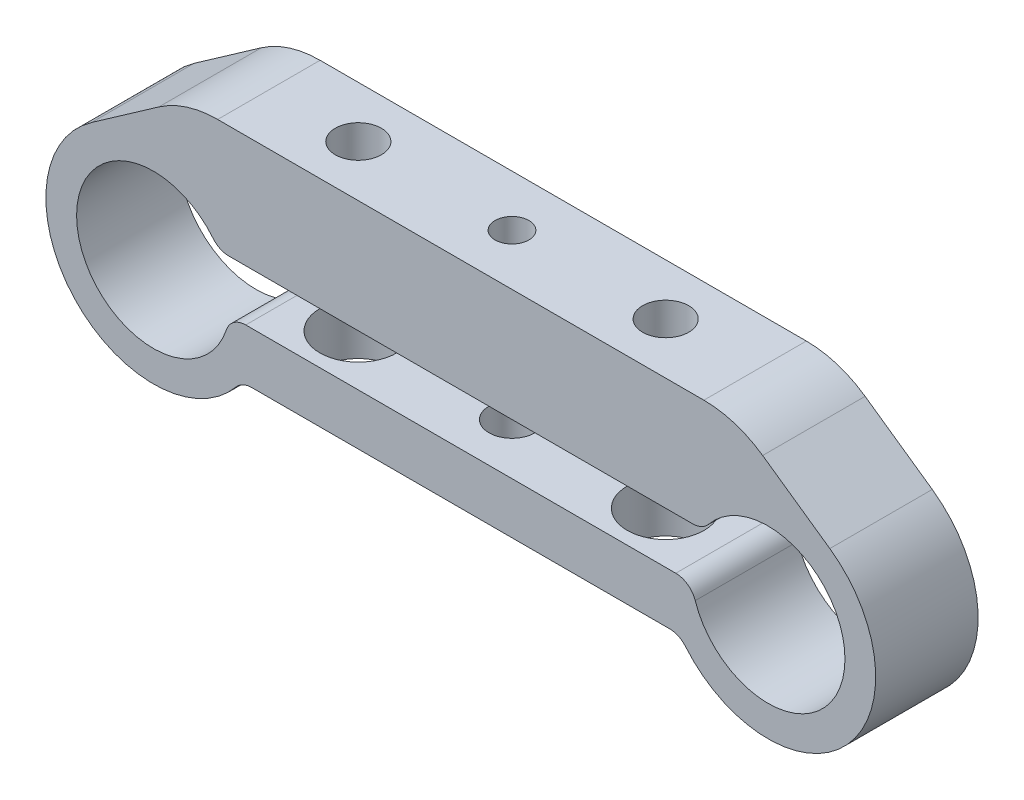
ISO-10303-21;
HEADER;
FILE_DESCRIPTION(('STEP AP214'),'2;1');
FILE_NAME('part.step','',(''),(''),'','','');
FILE_SCHEMA(('AUTOMOTIVE_DESIGN { 1 0 10303 214 1 1 1 1 }'));
ENDSEC;
DATA;
#1=APPLICATION_CONTEXT('core data for automotive mechanical design processes');
#2=APPLICATION_PROTOCOL_DEFINITION('international standard','automotive_design',2000,#1);
#3=PRODUCT_CONTEXT('',#1,'mechanical');
#4=PRODUCT('Part','Part','',(#3));
#5=PRODUCT_RELATED_PRODUCT_CATEGORY('part','',(#4));
#6=PRODUCT_DEFINITION_FORMATION('','',#4);
#7=PRODUCT_DEFINITION_CONTEXT('part definition',#1,'design');
#8=PRODUCT_DEFINITION('design','',#6,#7);
#9=PRODUCT_DEFINITION_SHAPE('','',#8);
#10=(LENGTH_UNIT() NAMED_UNIT(*) SI_UNIT(.MILLI.,.METRE.));
#11=(NAMED_UNIT(*) PLANE_ANGLE_UNIT() SI_UNIT($,.RADIAN.));
#12=(NAMED_UNIT(*) SI_UNIT($,.STERADIAN.) SOLID_ANGLE_UNIT());
#13=UNCERTAINTY_MEASURE_WITH_UNIT(LENGTH_MEASURE(1.E-05),#10,'distance_accuracy_value','');
#14=(GEOMETRIC_REPRESENTATION_CONTEXT(3) GLOBAL_UNCERTAINTY_ASSIGNED_CONTEXT((#13)) GLOBAL_UNIT_ASSIGNED_CONTEXT((#10,
#11,#12)) REPRESENTATION_CONTEXT('',''));
#15=CARTESIAN_POINT('',(0.,0.,0.));
#16=DIRECTION('',(0.,0.,1.));
#17=DIRECTION('',(1.,0.,0.));
#18=AXIS2_PLACEMENT_3D('',#15,#16,#17);
#19=CARTESIAN_POINT('',(-30.,0.,10.));
#20=DIRECTION('',(0.,0.,1.));
#21=DIRECTION('',(1.,0.,0.));
#22=AXIS2_PLACEMENT_3D('',#19,#20,#21);
#23=PLANE('',#22);
#24=DIRECTION('',(-1.,0.,0.));
#25=VECTOR('',#24,1.);
#26=CARTESIAN_POINT('',(-26.8839712528898,15.,10.));
#27=LINE('',#26,#25);
#28=CARTESIAN_POINT('',(23.7309833640999,15.,10.));
#29=VERTEX_POINT('',#28);
#30=CARTESIAN_POINT('',(-23.7309833641,15.,10.));
#31=VERTEX_POINT('',#30);
#32=EDGE_CURVE('E172',#29,#31,#27,.T.);
#33=ORIENTED_EDGE('',*,*,#32,.T.);
#34=CARTESIAN_POINT('',(-23.7309833641,5.,10.));
#35=DIRECTION('',(0.,0.,1.));
#36=DIRECTION('',(1.,0.,0.));
#37=AXIS2_PLACEMENT_3D('',#34,#35,#36);
#38=CIRCLE('',#37,10.);
#39=CARTESIAN_POINT('',(-29.4667477276105,13.1915204428899,10.));
#40=VERTEX_POINT('',#39);
#41=EDGE_CURVE('E168',#31,#40,#38,.T.);
#42=ORIENTED_EDGE('',*,*,#41,.T.);
#43=DIRECTION('',(-0.819152044288991,-0.573576436351047,0.));
#44=VECTOR('',#43,1.);
#45=CARTESIAN_POINT('',(-36.022552581686,8.60109646503441,10.));
#46=LINE('',#45,#44);
#47=CARTESIAN_POINT('',(-36.022552581686,8.60109646503441,10.));
#48=VERTEX_POINT('',#47);
#49=EDGE_CURVE('E161',#40,#48,#46,.T.);
#50=ORIENTED_EDGE('',*,*,#49,.T.);
#51=CARTESIAN_POINT('',(-30.,0.,10.));
#52=DIRECTION('',(0.,0.,1.));
#53=DIRECTION('',(1.,0.,0.));
#54=AXIS2_PLACEMENT_3D('',#51,#52,#53);
#55=CIRCLE('',#54,10.5);
#56=CARTESIAN_POINT('',(-21.9320634608346,-6.72,10.));
#57=VERTEX_POINT('',#56);
#58=EDGE_CURVE('E165',#48,#57,#55,.T.);
#59=ORIENTED_EDGE('',*,*,#58,.T.);
#60=CARTESIAN_POINT('',(-20.3953136438507,-8.,10.));
#61=DIRECTION('',(0.,0.,1.));
#62=DIRECTION('',(1.,0.,0.));
#63=AXIS2_PLACEMENT_3D('',#60,#61,#62);
#64=CIRCLE('',#63,2.);
#65=CARTESIAN_POINT('',(-20.3953136438507,-6.,10.));
#66=VERTEX_POINT('',#65);
#67=EDGE_CURVE('E11',#57,#66,#64,.F.);
#68=ORIENTED_EDGE('',*,*,#67,.T.);
#69=DIRECTION('',(1.,0.,0.));
#70=VECTOR('',#69,1.);
#71=CARTESIAN_POINT('',(-21.383156030193,-6.,10.));
#72=LINE('',#71,#70);
#73=CARTESIAN_POINT('',(20.3953136438507,-6.,10.));
#74=VERTEX_POINT('',#73);
#75=EDGE_CURVE('E188',#66,#74,#72,.T.);
#76=ORIENTED_EDGE('',*,*,#75,.T.);
#77=CARTESIAN_POINT('',(20.3953136438507,-8.,10.));
#78=DIRECTION('',(0.,0.,1.));
#79=DIRECTION('',(1.,0.,0.));
#80=AXIS2_PLACEMENT_3D('',#77,#78,#79);
#81=CIRCLE('',#80,2.);
#82=CARTESIAN_POINT('',(21.9320634608346,-6.72,10.));
#83=VERTEX_POINT('',#82);
#84=EDGE_CURVE('E274',#74,#83,#81,.F.);
#85=ORIENTED_EDGE('',*,*,#84,.T.);
#86=CARTESIAN_POINT('',(30.,0.,10.));
#87=DIRECTION('',(0.,0.,1.));
#88=DIRECTION('',(1.,0.,0.));
#89=AXIS2_PLACEMENT_3D('',#86,#87,#88);
#90=CIRCLE('',#89,10.5);
#91=CARTESIAN_POINT('',(36.0225525816859,8.60109646503445,10.));
#92=VERTEX_POINT('',#91);
#93=EDGE_CURVE('E191',#83,#92,#90,.T.);
#94=ORIENTED_EDGE('',*,*,#93,.T.);
#95=DIRECTION('',(-0.819152044288995,0.573576436351041,0.));
#96=VECTOR('',#95,1.);
#97=CARTESIAN_POINT('',(36.0225525816859,8.60109646503445,10.));
#98=LINE('',#97,#96);
#99=CARTESIAN_POINT('',(29.4667477276103,13.1915204428899,10.));
#100=VERTEX_POINT('',#99);
#101=EDGE_CURVE('E211',#92,#100,#98,.T.);
#102=ORIENTED_EDGE('',*,*,#101,.T.);
#103=CARTESIAN_POINT('',(23.7309833640999,5.,10.));
#104=DIRECTION('',(0.,0.,1.));
#105=DIRECTION('',(1.,0.,0.));
#106=AXIS2_PLACEMENT_3D('',#103,#104,#105);
#107=CIRCLE('',#106,10.);
#108=EDGE_CURVE('E224',#100,#29,#107,.T.);
#109=ORIENTED_EDGE('',*,*,#108,.T.);
#110=EDGE_LOOP('',(#33,#42,#50,#59,#68,#76,#85,#94,#102,#109));
#111=FACE_BOUND('',#110,.T.);
#112=DIRECTION('',(1.,0.,0.));
#113=VECTOR('',#112,1.);
#114=CARTESIAN_POINT('',(-22.5669656263407,-1.,10.));
#115=LINE('',#114,#113);
#116=CARTESIAN_POINT('',(-20.98612181134,-1.,10.));
#117=VERTEX_POINT('',#116);
#118=CARTESIAN_POINT('',(20.98612181134,-1.,10.));
#119=VERTEX_POINT('',#118);
#120=EDGE_CURVE('E322',#117,#119,#115,.T.);
#121=ORIENTED_EDGE('',*,*,#120,.F.);
#122=CARTESIAN_POINT('',(-20.98612181134,-3.,10.));
#123=DIRECTION('',(0.,0.,1.));
#124=DIRECTION('',(1.,0.,0.));
#125=AXIS2_PLACEMENT_3D('',#122,#123,#124);
#126=CIRCLE('',#125,2.);
#127=CARTESIAN_POINT('',(-22.8837803773737,-2.36842105263158,10.));
#128=VERTEX_POINT('',#127);
#129=EDGE_CURVE('E261',#117,#128,#126,.T.);
#130=ORIENTED_EDGE('',*,*,#129,.T.);
#131=CARTESIAN_POINT('',(-30.,0.,10.));
#132=DIRECTION('',(0.,0.,1.));
#133=DIRECTION('',(1.,0.,0.));
#134=AXIS2_PLACEMENT_3D('',#131,#132,#133);
#135=CIRCLE('',#134,7.5);
#136=CARTESIAN_POINT('',(-24.1851632121094,4.73684210526316,10.));
#137=VERTEX_POINT('',#136);
#138=EDGE_CURVE('E307',#137,#128,#135,.T.);
#139=ORIENTED_EDGE('',*,*,#138,.F.);
#140=CARTESIAN_POINT('',(-22.6345400686719,6.,10.));
#141=DIRECTION('',(0.,0.,1.));
#142=DIRECTION('',(1.,0.,0.));
#143=AXIS2_PLACEMENT_3D('',#140,#141,#142);
#144=CIRCLE('',#143,2.);
#145=CARTESIAN_POINT('',(-22.6345400686719,4.,10.));
#146=VERTEX_POINT('',#145);
#147=EDGE_CURVE('E259',#137,#146,#144,.T.);
#148=ORIENTED_EDGE('',*,*,#147,.T.);
#149=DIRECTION('',(-1.,0.,0.));
#150=VECTOR('',#149,1.);
#151=CARTESIAN_POINT('',(-23.6557112297752,4.,10.));
#152=LINE('',#151,#150);
#153=CARTESIAN_POINT('',(22.6345400686719,4.,10.));
#154=VERTEX_POINT('',#153);
#155=EDGE_CURVE('E200',#154,#146,#152,.T.);
#156=ORIENTED_EDGE('',*,*,#155,.F.);
#157=CARTESIAN_POINT('',(22.6345400686719,6.,10.));
#158=DIRECTION('',(0.,0.,1.));
#159=DIRECTION('',(1.,0.,0.));
#160=AXIS2_PLACEMENT_3D('',#157,#158,#159);
#161=CIRCLE('',#160,2.);
#162=CARTESIAN_POINT('',(24.1851632121094,4.73684210526316,10.));
#163=VERTEX_POINT('',#162);
#164=EDGE_CURVE('E50',#154,#163,#161,.T.);
#165=ORIENTED_EDGE('',*,*,#164,.T.);
#166=CARTESIAN_POINT('',(30.,0.,10.));
#167=DIRECTION('',(0.,0.,1.));
#168=DIRECTION('',(1.,0.,0.));
#169=AXIS2_PLACEMENT_3D('',#166,#167,#168);
#170=CIRCLE('',#169,7.5);
#171=CARTESIAN_POINT('',(22.8837803773737,-2.36842105263158,10.));
#172=VERTEX_POINT('',#171);
#173=EDGE_CURVE('E320',#172,#163,#170,.T.);
#174=ORIENTED_EDGE('',*,*,#173,.F.);
#175=CARTESIAN_POINT('',(20.98612181134,-3.,10.));
#176=DIRECTION('',(0.,0.,1.));
#177=DIRECTION('',(1.,0.,0.));
#178=AXIS2_PLACEMENT_3D('',#175,#176,#177);
#179=CIRCLE('',#178,2.);
#180=EDGE_CURVE('E257',#172,#119,#179,.T.);
#181=ORIENTED_EDGE('',*,*,#180,.T.);
#182=EDGE_LOOP('',(#121,#130,#139,#148,#156,#165,#174,#181));
#183=FACE_BOUND('',#182,.T.);
#184=ADVANCED_FACE('F35',(#111,#183),#23,.T.);
#185=CARTESIAN_POINT('',(-30.,0.,0.));
#186=DIRECTION('',(0.,0.,1.));
#187=DIRECTION('',(1.,0.,0.));
#188=AXIS2_PLACEMENT_3D('',#185,#186,#187);
#189=PLANE('',#188);
#190=DIRECTION('',(-0.819152044288991,-0.573576436351047,0.));
#191=VECTOR('',#190,1.);
#192=CARTESIAN_POINT('',(-36.022552581686,8.60109646503441,0.));
#193=LINE('',#192,#191);
#194=CARTESIAN_POINT('',(-29.4667477276105,13.1915204428899,0.));
#195=VERTEX_POINT('',#194);
#196=CARTESIAN_POINT('',(-36.022552581686,8.60109646503441,0.));
#197=VERTEX_POINT('',#196);
#198=EDGE_CURVE('E178',#195,#197,#193,.T.);
#199=ORIENTED_EDGE('',*,*,#198,.F.);
#200=CARTESIAN_POINT('',(-23.7309833641,5.,0.));
#201=DIRECTION('',(0.,0.,1.));
#202=DIRECTION('',(1.,0.,0.));
#203=AXIS2_PLACEMENT_3D('',#200,#201,#202);
#204=CIRCLE('',#203,10.);
#205=CARTESIAN_POINT('',(-23.7309833641,15.,0.));
#206=VERTEX_POINT('',#205);
#207=EDGE_CURVE('E217',#195,#206,#204,.F.);
#208=ORIENTED_EDGE('',*,*,#207,.T.);
#209=DIRECTION('',(-1.,0.,0.));
#210=VECTOR('',#209,1.);
#211=CARTESIAN_POINT('',(-26.8839712528898,15.,0.));
#212=LINE('',#211,#210);
#213=CARTESIAN_POINT('',(23.7309833640999,15.,0.));
#214=VERTEX_POINT('',#213);
#215=EDGE_CURVE('E199',#214,#206,#212,.T.);
#216=ORIENTED_EDGE('',*,*,#215,.F.);
#217=CARTESIAN_POINT('',(23.7309833640999,5.,0.));
#218=DIRECTION('',(0.,0.,1.));
#219=DIRECTION('',(1.,0.,0.));
#220=AXIS2_PLACEMENT_3D('',#217,#218,#219);
#221=CIRCLE('',#220,10.);
#222=CARTESIAN_POINT('',(29.4667477276103,13.1915204428899,0.));
#223=VERTEX_POINT('',#222);
#224=EDGE_CURVE('E215',#214,#223,#221,.F.);
#225=ORIENTED_EDGE('',*,*,#224,.T.);
#226=DIRECTION('',(-0.819152044288995,0.573576436351041,0.));
#227=VECTOR('',#226,1.);
#228=CARTESIAN_POINT('',(36.0225525816859,8.60109646503445,0.));
#229=LINE('',#228,#227);
#230=CARTESIAN_POINT('',(36.0225525816859,8.60109646503445,0.));
#231=VERTEX_POINT('',#230);
#232=EDGE_CURVE('E196',#231,#223,#229,.T.);
#233=ORIENTED_EDGE('',*,*,#232,.F.);
#234=CARTESIAN_POINT('',(30.,0.,0.));
#235=DIRECTION('',(0.,0.,1.));
#236=DIRECTION('',(1.,0.,0.));
#237=AXIS2_PLACEMENT_3D('',#234,#235,#236);
#238=CIRCLE('',#237,10.5);
#239=CARTESIAN_POINT('',(21.9320634608346,-6.72,0.));
#240=VERTEX_POINT('',#239);
#241=EDGE_CURVE('E209',#240,#231,#238,.T.);
#242=ORIENTED_EDGE('',*,*,#241,.F.);
#243=CARTESIAN_POINT('',(20.3953136438507,-8.,0.));
#244=DIRECTION('',(0.,0.,1.));
#245=DIRECTION('',(1.,0.,0.));
#246=AXIS2_PLACEMENT_3D('',#243,#244,#245);
#247=CIRCLE('',#246,2.);
#248=CARTESIAN_POINT('',(20.3953136438507,-6.,0.));
#249=VERTEX_POINT('',#248);
#250=EDGE_CURVE('E272',#240,#249,#247,.T.);
#251=ORIENTED_EDGE('',*,*,#250,.T.);
#252=DIRECTION('',(1.,0.,0.));
#253=VECTOR('',#252,1.);
#254=CARTESIAN_POINT('',(-21.383156030193,-6.,0.));
#255=LINE('',#254,#253);
#256=CARTESIAN_POINT('',(-20.3953136438507,-6.,0.));
#257=VERTEX_POINT('',#256);
#258=EDGE_CURVE('E206',#257,#249,#255,.T.);
#259=ORIENTED_EDGE('',*,*,#258,.F.);
#260=CARTESIAN_POINT('',(-20.3953136438507,-8.,0.));
#261=DIRECTION('',(0.,0.,1.));
#262=DIRECTION('',(1.,0.,0.));
#263=AXIS2_PLACEMENT_3D('',#260,#261,#262);
#264=CIRCLE('',#263,2.);
#265=CARTESIAN_POINT('',(-21.9320634608346,-6.72,0.));
#266=VERTEX_POINT('',#265);
#267=EDGE_CURVE('E43',#257,#266,#264,.T.);
#268=ORIENTED_EDGE('',*,*,#267,.T.);
#269=CARTESIAN_POINT('',(-30.,0.,0.));
#270=DIRECTION('',(0.,0.,1.));
#271=DIRECTION('',(1.,0.,0.));
#272=AXIS2_PLACEMENT_3D('',#269,#270,#271);
#273=CIRCLE('',#272,10.5);
#274=EDGE_CURVE('E204',#197,#266,#273,.T.);
#275=ORIENTED_EDGE('',*,*,#274,.F.);
#276=EDGE_LOOP('',(#199,#208,#216,#225,#233,#242,#251,#259,#268,#275));
#277=FACE_BOUND('',#276,.T.);
#278=CARTESIAN_POINT('',(-30.,0.,0.));
#279=DIRECTION('',(0.,0.,1.));
#280=DIRECTION('',(1.,0.,0.));
#281=AXIS2_PLACEMENT_3D('',#278,#279,#280);
#282=CIRCLE('',#281,7.5);
#283=CARTESIAN_POINT('',(-24.1851632121094,4.73684210526316,0.));
#284=VERTEX_POINT('',#283);
#285=CARTESIAN_POINT('',(-22.8837803773737,-2.36842105263158,0.));
#286=VERTEX_POINT('',#285);
#287=EDGE_CURVE('E314',#284,#286,#282,.T.);
#288=ORIENTED_EDGE('',*,*,#287,.T.);
#289=CARTESIAN_POINT('',(-20.98612181134,-3.,0.));
#290=DIRECTION('',(0.,0.,1.));
#291=DIRECTION('',(1.,0.,0.));
#292=AXIS2_PLACEMENT_3D('',#289,#290,#291);
#293=CIRCLE('',#292,2.);
#294=CARTESIAN_POINT('',(-20.98612181134,-1.,0.));
#295=VERTEX_POINT('',#294);
#296=EDGE_CURVE('E249',#286,#295,#293,.F.);
#297=ORIENTED_EDGE('',*,*,#296,.T.);
#298=DIRECTION('',(1.,0.,0.));
#299=VECTOR('',#298,1.);
#300=CARTESIAN_POINT('',(-22.5669656263407,-1.,0.));
#301=LINE('',#300,#299);
#302=CARTESIAN_POINT('',(20.98612181134,-1.,0.));
#303=VERTEX_POINT('',#302);
#304=EDGE_CURVE('E311',#295,#303,#301,.T.);
#305=ORIENTED_EDGE('',*,*,#304,.T.);
#306=CARTESIAN_POINT('',(20.98612181134,-3.,0.));
#307=DIRECTION('',(0.,0.,1.));
#308=DIRECTION('',(1.,0.,0.));
#309=AXIS2_PLACEMENT_3D('',#306,#307,#308);
#310=CIRCLE('',#309,2.);
#311=CARTESIAN_POINT('',(22.8837803773737,-2.36842105263158,0.));
#312=VERTEX_POINT('',#311);
#313=EDGE_CURVE('E245',#303,#312,#310,.F.);
#314=ORIENTED_EDGE('',*,*,#313,.T.);
#315=CARTESIAN_POINT('',(30.,0.,0.));
#316=DIRECTION('',(0.,0.,1.));
#317=DIRECTION('',(1.,0.,0.));
#318=AXIS2_PLACEMENT_3D('',#315,#316,#317);
#319=CIRCLE('',#318,7.5);
#320=CARTESIAN_POINT('',(24.1851632121094,4.73684210526316,0.));
#321=VERTEX_POINT('',#320);
#322=EDGE_CURVE('E308',#312,#321,#319,.T.);
#323=ORIENTED_EDGE('',*,*,#322,.T.);
#324=CARTESIAN_POINT('',(22.6345400686719,6.,0.));
#325=DIRECTION('',(0.,0.,1.));
#326=DIRECTION('',(1.,0.,0.));
#327=AXIS2_PLACEMENT_3D('',#324,#325,#326);
#328=CIRCLE('',#327,2.);
#329=CARTESIAN_POINT('',(22.6345400686719,4.,0.));
#330=VERTEX_POINT('',#329);
#331=EDGE_CURVE('E243',#321,#330,#328,.F.);
#332=ORIENTED_EDGE('',*,*,#331,.T.);
#333=DIRECTION('',(-1.,0.,0.));
#334=VECTOR('',#333,1.);
#335=CARTESIAN_POINT('',(-23.6557112297752,4.,0.));
#336=LINE('',#335,#334);
#337=CARTESIAN_POINT('',(-22.6345400686719,4.,0.));
#338=VERTEX_POINT('',#337);
#339=EDGE_CURVE('E304',#330,#338,#336,.T.);
#340=ORIENTED_EDGE('',*,*,#339,.T.);
#341=CARTESIAN_POINT('',(-22.6345400686719,6.,0.));
#342=DIRECTION('',(0.,0.,1.));
#343=DIRECTION('',(1.,0.,0.));
#344=AXIS2_PLACEMENT_3D('',#341,#342,#343);
#345=CIRCLE('',#344,2.);
#346=EDGE_CURVE('E247',#338,#284,#345,.F.);
#347=ORIENTED_EDGE('',*,*,#346,.T.);
#348=EDGE_LOOP('',(#288,#297,#305,#314,#323,#332,#340,#347));
#349=FACE_BOUND('',#348,.T.);
#350=ADVANCED_FACE('F277',(#277,#349),#189,.F.);
#351=CARTESIAN_POINT('',(36.0225525816859,8.60109646503445,10.));
#352=DIRECTION('',(-0.573576436351041,-0.819152044288995,0.));
#353=DIRECTION('',(0.819152044288995,-0.573576436351041,0.));
#354=AXIS2_PLACEMENT_3D('',#351,#352,#353);
#355=PLANE('',#354);
#356=ORIENTED_EDGE('',*,*,#232,.T.);
#357=DIRECTION('',(0.,0.,-1.));
#358=VECTOR('',#357,1.);
#359=CARTESIAN_POINT('',(29.4667477276103,13.1915204428899,10.));
#360=LINE('',#359,#358);
#361=EDGE_CURVE('E227',#223,#100,#360,.F.);
#362=ORIENTED_EDGE('',*,*,#361,.T.);
#363=ORIENTED_EDGE('',*,*,#101,.F.);
#364=DIRECTION('',(0.,0.,-1.));
#365=VECTOR('',#364,1.);
#366=CARTESIAN_POINT('',(36.0225525816859,8.60109646503445,10.));
#367=LINE('',#366,#365);
#368=EDGE_CURVE('E183',#92,#231,#367,.T.);
#369=ORIENTED_EDGE('',*,*,#368,.T.);
#370=EDGE_LOOP('',(#356,#362,#363,#369));
#371=FACE_BOUND('',#370,.T.);
#372=ADVANCED_FACE('F299',(#371),#355,.F.);
#373=CARTESIAN_POINT('',(-26.8839712528898,15.,10.));
#374=DIRECTION('',(0.,-1.,0.));
#375=DIRECTION('',(0.,0.,-1.));
#376=AXIS2_PLACEMENT_3D('',#373,#374,#375);
#377=PLANE('',#376);
#378=CARTESIAN_POINT('',(0.,15.,5.));
#379=DIRECTION('',(0.,-1.,0.));
#380=DIRECTION('',(0.,0.,-1.));
#381=AXIS2_PLACEMENT_3D('',#378,#379,#380);
#382=CIRCLE('',#381,1.65);
#383=CARTESIAN_POINT('',(0.,15.,3.35));
#384=VERTEX_POINT('',#383);
#385=EDGE_CURVE('E356',#384,#384,#382,.T.);
#386=ORIENTED_EDGE('',*,*,#385,.T.);
#387=EDGE_LOOP('',(#386));
#388=FACE_BOUND('',#387,.T.);
#389=CARTESIAN_POINT('',(15.,15.,5.));
#390=DIRECTION('',(0.,-1.,0.));
#391=DIRECTION('',(0.,0.,-1.));
#392=AXIS2_PLACEMENT_3D('',#389,#390,#391);
#393=CIRCLE('',#392,2.25);
#394=CARTESIAN_POINT('',(15.,15.,2.75));
#395=VERTEX_POINT('',#394);
#396=EDGE_CURVE('E344',#395,#395,#393,.T.);
#397=ORIENTED_EDGE('',*,*,#396,.T.);
#398=EDGE_LOOP('',(#397));
#399=FACE_BOUND('',#398,.T.);
#400=CARTESIAN_POINT('',(-15.,15.,5.));
#401=DIRECTION('',(0.,-1.,0.));
#402=DIRECTION('',(0.,0.,-1.));
#403=AXIS2_PLACEMENT_3D('',#400,#401,#402);
#404=CIRCLE('',#403,2.25);
#405=CARTESIAN_POINT('',(-15.,15.,2.75));
#406=VERTEX_POINT('',#405);
#407=EDGE_CURVE('E338',#406,#406,#404,.T.);
#408=ORIENTED_EDGE('',*,*,#407,.T.);
#409=EDGE_LOOP('',(#408));
#410=FACE_BOUND('',#409,.T.);
#411=ORIENTED_EDGE('',*,*,#215,.T.);
#412=DIRECTION('',(0.,0.,-1.));
#413=VECTOR('',#412,1.);
#414=CARTESIAN_POINT('',(-23.7309833641,15.,10.));
#415=LINE('',#414,#413);
#416=EDGE_CURVE('E222',#206,#31,#415,.F.);
#417=ORIENTED_EDGE('',*,*,#416,.T.);
#418=ORIENTED_EDGE('',*,*,#32,.F.);
#419=DIRECTION('',(0.,0.,-1.));
#420=VECTOR('',#419,1.);
#421=CARTESIAN_POINT('',(23.7309833640999,15.,10.));
#422=LINE('',#421,#420);
#423=EDGE_CURVE('E219',#29,#214,#422,.T.);
#424=ORIENTED_EDGE('',*,*,#423,.T.);
#425=EDGE_LOOP('',(#411,#417,#418,#424));
#426=FACE_BOUND('',#425,.T.);
#427=ADVANCED_FACE('F423',(#388,#399,#410,#426),#377,.F.);
#428=CARTESIAN_POINT('',(-36.022552581686,8.60109646503441,10.));
#429=DIRECTION('',(0.573576436351047,-0.819152044288991,0.));
#430=DIRECTION('',(0.819152044288991,0.573576436351047,0.));
#431=AXIS2_PLACEMENT_3D('',#428,#429,#430);
#432=PLANE('',#431);
#433=ORIENTED_EDGE('',*,*,#49,.F.);
#434=DIRECTION('',(0.,0.,-1.));
#435=VECTOR('',#434,1.);
#436=CARTESIAN_POINT('',(-29.4667477276105,13.1915204428899,10.));
#437=LINE('',#436,#435);
#438=EDGE_CURVE('E182',#40,#195,#437,.T.);
#439=ORIENTED_EDGE('',*,*,#438,.T.);
#440=ORIENTED_EDGE('',*,*,#198,.T.);
#441=DIRECTION('',(0.,0.,-1.));
#442=VECTOR('',#441,1.);
#443=CARTESIAN_POINT('',(-36.022552581686,8.60109646503441,10.));
#444=LINE('',#443,#442);
#445=EDGE_CURVE('E175',#48,#197,#444,.T.);
#446=ORIENTED_EDGE('',*,*,#445,.F.);
#447=EDGE_LOOP('',(#433,#439,#440,#446));
#448=FACE_BOUND('',#447,.T.);
#449=ADVANCED_FACE('F176',(#448),#432,.F.);
#450=CARTESIAN_POINT('',(-30.,0.,10.));
#451=DIRECTION('',(0.,0.,-1.));
#452=DIRECTION('',(-1.,0.,0.));
#453=AXIS2_PLACEMENT_3D('',#450,#451,#452);
#454=CYLINDRICAL_SURFACE('',#453,10.5);
#455=ORIENTED_EDGE('',*,*,#274,.T.);
#456=DIRECTION('',(0.,0.,-1.));
#457=VECTOR('',#456,1.);
#458=CARTESIAN_POINT('',(-21.9320634608346,-6.72,10.));
#459=LINE('',#458,#457);
#460=EDGE_CURVE('E187',#266,#57,#459,.F.);
#461=ORIENTED_EDGE('',*,*,#460,.T.);
#462=ORIENTED_EDGE('',*,*,#58,.F.);
#463=ORIENTED_EDGE('',*,*,#445,.T.);
#464=EDGE_LOOP('',(#455,#461,#462,#463));
#465=FACE_BOUND('',#464,.T.);
#466=ADVANCED_FACE('F185',(#465),#454,.T.);
#467=CARTESIAN_POINT('',(-21.383156030193,-6.,10.));
#468=DIRECTION('',(0.,1.,0.));
#469=DIRECTION('',(0.,0.,1.));
#470=AXIS2_PLACEMENT_3D('',#467,#468,#469);
#471=PLANE('',#470);
#472=CARTESIAN_POINT('',(0.,-6.,5.));
#473=DIRECTION('',(0.,-1.,0.));
#474=DIRECTION('',(0.,0.,-1.));
#475=AXIS2_PLACEMENT_3D('',#472,#473,#474);
#476=CIRCLE('',#475,2.24999999999999);
#477=CARTESIAN_POINT('',(0.,-6.,2.75000000000001));
#478=VERTEX_POINT('',#477);
#479=EDGE_CURVE('E353',#478,#478,#476,.T.);
#480=ORIENTED_EDGE('',*,*,#479,.F.);
#481=EDGE_LOOP('',(#480));
#482=FACE_BOUND('',#481,.T.);
#483=CARTESIAN_POINT('',(15.,-6.,5.));
#484=DIRECTION('',(0.,-1.,0.));
#485=DIRECTION('',(0.,0.,-1.));
#486=AXIS2_PLACEMENT_3D('',#483,#484,#485);
#487=CIRCLE('',#486,3.75);
#488=CARTESIAN_POINT('',(15.,-6.,1.25));
#489=VERTEX_POINT('',#488);
#490=EDGE_CURVE('E332',#489,#489,#487,.T.);
#491=ORIENTED_EDGE('',*,*,#490,.F.);
#492=EDGE_LOOP('',(#491));
#493=FACE_BOUND('',#492,.T.);
#494=CARTESIAN_POINT('',(-15.,-6.,5.));
#495=DIRECTION('',(0.,-1.,0.));
#496=DIRECTION('',(0.,0.,-1.));
#497=AXIS2_PLACEMENT_3D('',#494,#495,#496);
#498=CIRCLE('',#497,3.75);
#499=CARTESIAN_POINT('',(-15.,-6.,1.25));
#500=VERTEX_POINT('',#499);
#501=EDGE_CURVE('E317',#500,#500,#498,.T.);
#502=ORIENTED_EDGE('',*,*,#501,.F.);
#503=EDGE_LOOP('',(#502));
#504=FACE_BOUND('',#503,.T.);
#505=ORIENTED_EDGE('',*,*,#258,.T.);
#506=DIRECTION('',(0.,0.,1.));
#507=VECTOR('',#506,1.);
#508=CARTESIAN_POINT('',(20.3953136438507,-6.,10.));
#509=LINE('',#508,#507);
#510=EDGE_CURVE('E235',#249,#74,#509,.T.);
#511=ORIENTED_EDGE('',*,*,#510,.T.);
#512=ORIENTED_EDGE('',*,*,#75,.F.);
#513=DIRECTION('',(0.,0.,1.));
#514=VECTOR('',#513,1.);
#515=CARTESIAN_POINT('',(-20.3953136438507,-6.,0.));
#516=LINE('',#515,#514);
#517=EDGE_CURVE('E232',#66,#257,#516,.F.);
#518=ORIENTED_EDGE('',*,*,#517,.T.);
#519=EDGE_LOOP('',(#505,#511,#512,#518));
#520=FACE_BOUND('',#519,.T.);
#521=ADVANCED_FACE('F285',(#482,#493,#504,#520),#471,.F.);
#522=CARTESIAN_POINT('',(30.,0.,10.));
#523=DIRECTION('',(0.,0.,-1.));
#524=DIRECTION('',(-1.,0.,0.));
#525=AXIS2_PLACEMENT_3D('',#522,#523,#524);
#526=CYLINDRICAL_SURFACE('',#525,10.5);
#527=ORIENTED_EDGE('',*,*,#93,.F.);
#528=DIRECTION('',(0.,0.,-1.));
#529=VECTOR('',#528,1.);
#530=CARTESIAN_POINT('',(21.9320634608346,-6.72,10.));
#531=LINE('',#530,#529);
#532=EDGE_CURVE('E229',#83,#240,#531,.T.);
#533=ORIENTED_EDGE('',*,*,#532,.T.);
#534=ORIENTED_EDGE('',*,*,#241,.T.);
#535=ORIENTED_EDGE('',*,*,#368,.F.);
#536=EDGE_LOOP('',(#527,#533,#534,#535));
#537=FACE_BOUND('',#536,.T.);
#538=ADVANCED_FACE('F294',(#537),#526,.T.);
#539=CARTESIAN_POINT('',(-30.,0.,10.));
#540=DIRECTION('',(0.,0.,-1.));
#541=DIRECTION('',(-1.,0.,0.));
#542=AXIS2_PLACEMENT_3D('',#539,#540,#541);
#543=CYLINDRICAL_SURFACE('',#542,7.5);
#544=ORIENTED_EDGE('',*,*,#138,.T.);
#545=DIRECTION('',(0.,0.,-1.));
#546=VECTOR('',#545,1.);
#547=CARTESIAN_POINT('',(-22.8837803773737,-2.36842105263158,10.));
#548=LINE('',#547,#546);
#549=EDGE_CURVE('E240',#128,#286,#548,.T.);
#550=ORIENTED_EDGE('',*,*,#549,.T.);
#551=ORIENTED_EDGE('',*,*,#287,.F.);
#552=DIRECTION('',(0.,0.,-1.));
#553=VECTOR('',#552,1.);
#554=CARTESIAN_POINT('',(-24.1851632121094,4.73684210526316,10.));
#555=LINE('',#554,#553);
#556=EDGE_CURVE('E238',#284,#137,#555,.F.);
#557=ORIENTED_EDGE('',*,*,#556,.T.);
#558=EDGE_LOOP('',(#544,#550,#551,#557));
#559=FACE_BOUND('',#558,.T.);
#560=ADVANCED_FACE('F384',(#559),#543,.F.);
#561=CARTESIAN_POINT('',(-22.5669656263407,-1.,10.));
#562=DIRECTION('',(0.,1.,0.));
#563=DIRECTION('',(0.,0.,1.));
#564=AXIS2_PLACEMENT_3D('',#561,#562,#563);
#565=PLANE('',#564);
#566=CARTESIAN_POINT('',(0.,-1.,5.));
#567=DIRECTION('',(0.,1.,0.));
#568=DIRECTION('',(0.,0.,1.));
#569=AXIS2_PLACEMENT_3D('',#566,#567,#568);
#570=CIRCLE('',#569,2.24999999999999);
#571=CARTESIAN_POINT('',(0.,-1.,7.24999999999999));
#572=VERTEX_POINT('',#571);
#573=EDGE_CURVE('E350',#572,#572,#570,.T.);
#574=ORIENTED_EDGE('',*,*,#573,.F.);
#575=EDGE_LOOP('',(#574));
#576=FACE_BOUND('',#575,.T.);
#577=CARTESIAN_POINT('',(15.,-0.999999999999999,5.));
#578=DIRECTION('',(0.,1.,0.));
#579=DIRECTION('',(0.,0.,1.));
#580=AXIS2_PLACEMENT_3D('',#577,#578,#579);
#581=CIRCLE('',#580,3.75);
#582=CARTESIAN_POINT('',(15.,-0.999999999999999,8.75));
#583=VERTEX_POINT('',#582);
#584=EDGE_CURVE('E335',#583,#583,#581,.F.);
#585=ORIENTED_EDGE('',*,*,#584,.T.);
#586=EDGE_LOOP('',(#585));
#587=FACE_BOUND('',#586,.T.);
#588=CARTESIAN_POINT('',(-15.,-0.999999999999999,5.));
#589=DIRECTION('',(0.,1.,0.));
#590=DIRECTION('',(0.,0.,1.));
#591=AXIS2_PLACEMENT_3D('',#588,#589,#590);
#592=CIRCLE('',#591,3.75);
#593=CARTESIAN_POINT('',(-15.,-0.999999999999999,8.75));
#594=VERTEX_POINT('',#593);
#595=EDGE_CURVE('E329',#594,#594,#592,.F.);
#596=ORIENTED_EDGE('',*,*,#595,.T.);
#597=EDGE_LOOP('',(#596));
#598=FACE_BOUND('',#597,.T.);
#599=ORIENTED_EDGE('',*,*,#304,.F.);
#600=DIRECTION('',(0.,0.,-1.));
#601=VECTOR('',#600,1.);
#602=CARTESIAN_POINT('',(-20.98612181134,-1.,10.));
#603=LINE('',#602,#601);
#604=EDGE_CURVE('E254',#295,#117,#603,.F.);
#605=ORIENTED_EDGE('',*,*,#604,.T.);
#606=ORIENTED_EDGE('',*,*,#120,.T.);
#607=DIRECTION('',(0.,0.,-1.));
#608=VECTOR('',#607,1.);
#609=CARTESIAN_POINT('',(20.98612181134,-1.,10.));
#610=LINE('',#609,#608);
#611=EDGE_CURVE('E251',#119,#303,#610,.T.);
#612=ORIENTED_EDGE('',*,*,#611,.T.);
#613=EDGE_LOOP('',(#599,#605,#606,#612));
#614=FACE_BOUND('',#613,.T.);
#615=ADVANCED_FACE('F393',(#576,#587,#598,#614),#565,.T.);
#616=CARTESIAN_POINT('',(30.,0.,10.));
#617=DIRECTION('',(0.,0.,-1.));
#618=DIRECTION('',(-1.,0.,0.));
#619=AXIS2_PLACEMENT_3D('',#616,#617,#618);
#620=CYLINDRICAL_SURFACE('',#619,7.5);
#621=ORIENTED_EDGE('',*,*,#322,.F.);
#622=DIRECTION('',(0.,0.,-1.));
#623=VECTOR('',#622,1.);
#624=CARTESIAN_POINT('',(22.8837803773737,-2.36842105263158,10.));
#625=LINE('',#624,#623);
#626=EDGE_CURVE('E57',#312,#172,#625,.F.);
#627=ORIENTED_EDGE('',*,*,#626,.T.);
#628=ORIENTED_EDGE('',*,*,#173,.T.);
#629=DIRECTION('',(0.,0.,-1.));
#630=VECTOR('',#629,1.);
#631=CARTESIAN_POINT('',(24.1851632121094,4.73684210526316,10.));
#632=LINE('',#631,#630);
#633=EDGE_CURVE('E268',#163,#321,#632,.T.);
#634=ORIENTED_EDGE('',*,*,#633,.T.);
#635=EDGE_LOOP('',(#621,#627,#628,#634));
#636=FACE_BOUND('',#635,.T.);
#637=ADVANCED_FACE('F369',(#636),#620,.F.);
#638=CARTESIAN_POINT('',(-23.6557112297752,4.,10.));
#639=DIRECTION('',(0.,-1.,0.));
#640=DIRECTION('',(0.,0.,-1.));
#641=AXIS2_PLACEMENT_3D('',#638,#639,#640);
#642=PLANE('',#641);
#643=CARTESIAN_POINT('',(0.,4.,5.));
#644=DIRECTION('',(0.,-1.,0.));
#645=DIRECTION('',(0.,0.,-1.));
#646=AXIS2_PLACEMENT_3D('',#643,#644,#645);
#647=CIRCLE('',#646,1.64999999999999);
#648=CARTESIAN_POINT('',(0.,4.,3.35000000000001));
#649=VERTEX_POINT('',#648);
#650=EDGE_CURVE('E359',#649,#649,#647,.T.);
#651=ORIENTED_EDGE('',*,*,#650,.F.);
#652=EDGE_LOOP('',(#651));
#653=FACE_BOUND('',#652,.T.);
#654=CARTESIAN_POINT('',(15.,4.,5.));
#655=DIRECTION('',(0.,-1.,0.));
#656=DIRECTION('',(0.,0.,-1.));
#657=AXIS2_PLACEMENT_3D('',#654,#655,#656);
#658=CIRCLE('',#657,2.24999999999999);
#659=CARTESIAN_POINT('',(15.,4.,2.75000000000001));
#660=VERTEX_POINT('',#659);
#661=EDGE_CURVE('E347',#660,#660,#658,.T.);
#662=ORIENTED_EDGE('',*,*,#661,.F.);
#663=EDGE_LOOP('',(#662));
#664=FACE_BOUND('',#663,.T.);
#665=CARTESIAN_POINT('',(-15.,4.,5.));
#666=DIRECTION('',(0.,-1.,0.));
#667=DIRECTION('',(0.,0.,-1.));
#668=AXIS2_PLACEMENT_3D('',#665,#666,#667);
#669=CIRCLE('',#668,2.24999999999999);
#670=CARTESIAN_POINT('',(-15.,4.,2.75000000000001));
#671=VERTEX_POINT('',#670);
#672=EDGE_CURVE('E341',#671,#671,#669,.T.);
#673=ORIENTED_EDGE('',*,*,#672,.F.);
#674=EDGE_LOOP('',(#673));
#675=FACE_BOUND('',#674,.T.);
#676=ORIENTED_EDGE('',*,*,#155,.T.);
#677=DIRECTION('',(0.,0.,-1.));
#678=VECTOR('',#677,1.);
#679=CARTESIAN_POINT('',(-22.6345400686719,4.,10.));
#680=LINE('',#679,#678);
#681=EDGE_CURVE('E265',#146,#338,#680,.T.);
#682=ORIENTED_EDGE('',*,*,#681,.T.);
#683=ORIENTED_EDGE('',*,*,#339,.F.);
#684=DIRECTION('',(0.,0.,-1.));
#685=VECTOR('',#684,1.);
#686=CARTESIAN_POINT('',(22.6345400686719,4.,10.));
#687=LINE('',#686,#685);
#688=EDGE_CURVE('E263',#330,#154,#687,.F.);
#689=ORIENTED_EDGE('',*,*,#688,.T.);
#690=EDGE_LOOP('',(#676,#682,#683,#689));
#691=FACE_BOUND('',#690,.T.);
#692=ADVANCED_FACE('F365',(#653,#664,#675,#691),#642,.T.);
#693=CARTESIAN_POINT('',(-15.,15.001,5.));
#694=DIRECTION('',(0.,-1.,0.));
#695=DIRECTION('',(0.,0.,-1.));
#696=AXIS2_PLACEMENT_3D('',#693,#694,#695);
#697=CYLINDRICAL_SURFACE('',#696,3.75);
#698=ORIENTED_EDGE('',*,*,#595,.F.);
#699=EDGE_LOOP('',(#698));
#700=FACE_BOUND('',#699,.T.);
#701=ORIENTED_EDGE('',*,*,#501,.T.);
#702=EDGE_LOOP('',(#701));
#703=FACE_BOUND('',#702,.T.);
#704=ADVANCED_FACE('F368',(#700,#703),#697,.F.);
#705=CARTESIAN_POINT('',(15.,15.001,5.));
#706=DIRECTION('',(0.,-1.,0.));
#707=DIRECTION('',(0.,0.,-1.));
#708=AXIS2_PLACEMENT_3D('',#705,#706,#707);
#709=CYLINDRICAL_SURFACE('',#708,3.75);
#710=ORIENTED_EDGE('',*,*,#584,.F.);
#711=EDGE_LOOP('',(#710));
#712=FACE_BOUND('',#711,.T.);
#713=ORIENTED_EDGE('',*,*,#490,.T.);
#714=EDGE_LOOP('',(#713));
#715=FACE_BOUND('',#714,.T.);
#716=ADVANCED_FACE('F523',(#712,#715),#709,.F.);
#717=CARTESIAN_POINT('',(-15.,4.,5.));
#718=DIRECTION('',(0.,-1.,0.));
#719=DIRECTION('',(0.,0.,-1.));
#720=AXIS2_PLACEMENT_3D('',#717,#718,#719);
#721=CYLINDRICAL_SURFACE('',#720,2.24999999999999);
#722=ORIENTED_EDGE('',*,*,#407,.F.);
#723=EDGE_LOOP('',(#722));
#724=FACE_BOUND('',#723,.T.);
#725=ORIENTED_EDGE('',*,*,#672,.T.);
#726=EDGE_LOOP('',(#725));
#727=FACE_BOUND('',#726,.T.);
#728=ADVANCED_FACE('F514',(#724,#727),#721,.F.);
#729=CARTESIAN_POINT('',(15.,4.,5.));
#730=DIRECTION('',(0.,-1.,0.));
#731=DIRECTION('',(0.,0.,-1.));
#732=AXIS2_PLACEMENT_3D('',#729,#730,#731);
#733=CYLINDRICAL_SURFACE('',#732,2.24999999999999);
#734=ORIENTED_EDGE('',*,*,#396,.F.);
#735=EDGE_LOOP('',(#734));
#736=FACE_BOUND('',#735,.T.);
#737=ORIENTED_EDGE('',*,*,#661,.T.);
#738=EDGE_LOOP('',(#737));
#739=FACE_BOUND('',#738,.T.);
#740=ADVANCED_FACE('F505',(#736,#739),#733,.F.);
#741=CARTESIAN_POINT('',(0.,-6.,5.));
#742=DIRECTION('',(0.,-1.,0.));
#743=DIRECTION('',(0.,0.,-1.));
#744=AXIS2_PLACEMENT_3D('',#741,#742,#743);
#745=CYLINDRICAL_SURFACE('',#744,2.24999999999999);
#746=ORIENTED_EDGE('',*,*,#479,.T.);
#747=EDGE_LOOP('',(#746));
#748=FACE_BOUND('',#747,.T.);
#749=ORIENTED_EDGE('',*,*,#573,.T.);
#750=EDGE_LOOP('',(#749));
#751=FACE_BOUND('',#750,.T.);
#752=ADVANCED_FACE('F494',(#748,#751),#745,.F.);
#753=CARTESIAN_POINT('',(0.,4.,5.));
#754=DIRECTION('',(0.,-1.,0.));
#755=DIRECTION('',(0.,0.,-1.));
#756=AXIS2_PLACEMENT_3D('',#753,#754,#755);
#757=CYLINDRICAL_SURFACE('',#756,1.64999999999999);
#758=ORIENTED_EDGE('',*,*,#385,.F.);
#759=EDGE_LOOP('',(#758));
#760=FACE_BOUND('',#759,.T.);
#761=ORIENTED_EDGE('',*,*,#650,.T.);
#762=EDGE_LOOP('',(#761));
#763=FACE_BOUND('',#762,.T.);
#764=ADVANCED_FACE('F363',(#760,#763),#757,.F.);
#765=CARTESIAN_POINT('',(-23.7309833641,5.,10.));
#766=DIRECTION('',(0.,0.,-1.));
#767=DIRECTION('',(-1.,0.,0.));
#768=AXIS2_PLACEMENT_3D('',#765,#766,#767);
#769=CYLINDRICAL_SURFACE('',#768,10.);
#770=ORIENTED_EDGE('',*,*,#41,.F.);
#771=ORIENTED_EDGE('',*,*,#416,.F.);
#772=ORIENTED_EDGE('',*,*,#207,.F.);
#773=ORIENTED_EDGE('',*,*,#438,.F.);
#774=EDGE_LOOP('',(#770,#771,#772,#773));
#775=FACE_BOUND('',#774,.T.);
#776=ADVANCED_FACE('F429',(#775),#769,.T.);
#777=CARTESIAN_POINT('',(23.7309833640999,5.,10.));
#778=DIRECTION('',(0.,0.,-1.));
#779=DIRECTION('',(-1.,0.,0.));
#780=AXIS2_PLACEMENT_3D('',#777,#778,#779);
#781=CYLINDRICAL_SURFACE('',#780,10.);
#782=ORIENTED_EDGE('',*,*,#108,.F.);
#783=ORIENTED_EDGE('',*,*,#361,.F.);
#784=ORIENTED_EDGE('',*,*,#224,.F.);
#785=ORIENTED_EDGE('',*,*,#423,.F.);
#786=EDGE_LOOP('',(#782,#783,#784,#785));
#787=FACE_BOUND('',#786,.T.);
#788=ADVANCED_FACE('F432',(#787),#781,.T.);
#789=CARTESIAN_POINT('',(20.3953136438507,-8.,10.));
#790=DIRECTION('',(0.,0.,-1.));
#791=DIRECTION('',(-1.,0.,0.));
#792=AXIS2_PLACEMENT_3D('',#789,#790,#791);
#793=CYLINDRICAL_SURFACE('',#792,2.);
#794=ORIENTED_EDGE('',*,*,#84,.F.);
#795=ORIENTED_EDGE('',*,*,#510,.F.);
#796=ORIENTED_EDGE('',*,*,#250,.F.);
#797=ORIENTED_EDGE('',*,*,#532,.F.);
#798=EDGE_LOOP('',(#794,#795,#796,#797));
#799=FACE_BOUND('',#798,.T.);
#800=ADVANCED_FACE('F288',(#799),#793,.F.);
#801=CARTESIAN_POINT('',(-20.3953136438507,-8.,10.));
#802=DIRECTION('',(0.,0.,-1.));
#803=DIRECTION('',(-1.,0.,0.));
#804=AXIS2_PLACEMENT_3D('',#801,#802,#803);
#805=CYLINDRICAL_SURFACE('',#804,2.);
#806=ORIENTED_EDGE('',*,*,#67,.F.);
#807=ORIENTED_EDGE('',*,*,#460,.F.);
#808=ORIENTED_EDGE('',*,*,#267,.F.);
#809=ORIENTED_EDGE('',*,*,#517,.F.);
#810=EDGE_LOOP('',(#806,#807,#808,#809));
#811=FACE_BOUND('',#810,.T.);
#812=ADVANCED_FACE('F281',(#811),#805,.F.);
#813=CARTESIAN_POINT('',(-20.98612181134,-3.,10.));
#814=DIRECTION('',(0.,0.,-1.));
#815=DIRECTION('',(-1.,0.,0.));
#816=AXIS2_PLACEMENT_3D('',#813,#814,#815);
#817=CYLINDRICAL_SURFACE('',#816,2.);
#818=ORIENTED_EDGE('',*,*,#129,.F.);
#819=ORIENTED_EDGE('',*,*,#604,.F.);
#820=ORIENTED_EDGE('',*,*,#296,.F.);
#821=ORIENTED_EDGE('',*,*,#549,.F.);
#822=EDGE_LOOP('',(#818,#819,#820,#821));
#823=FACE_BOUND('',#822,.T.);
#824=ADVANCED_FACE('F389',(#823),#817,.T.);
#825=CARTESIAN_POINT('',(-22.6345400686719,6.,10.));
#826=DIRECTION('',(0.,0.,-1.));
#827=DIRECTION('',(-1.,0.,0.));
#828=AXIS2_PLACEMENT_3D('',#825,#826,#827);
#829=CYLINDRICAL_SURFACE('',#828,2.);
#830=ORIENTED_EDGE('',*,*,#147,.F.);
#831=ORIENTED_EDGE('',*,*,#556,.F.);
#832=ORIENTED_EDGE('',*,*,#346,.F.);
#833=ORIENTED_EDGE('',*,*,#681,.F.);
#834=EDGE_LOOP('',(#830,#831,#832,#833));
#835=FACE_BOUND('',#834,.T.);
#836=ADVANCED_FACE('F380',(#835),#829,.T.);
#837=CARTESIAN_POINT('',(20.98612181134,-3.,10.));
#838=DIRECTION('',(0.,0.,-1.));
#839=DIRECTION('',(-1.,0.,0.));
#840=AXIS2_PLACEMENT_3D('',#837,#838,#839);
#841=CYLINDRICAL_SURFACE('',#840,2.);
#842=ORIENTED_EDGE('',*,*,#180,.F.);
#843=ORIENTED_EDGE('',*,*,#626,.F.);
#844=ORIENTED_EDGE('',*,*,#313,.F.);
#845=ORIENTED_EDGE('',*,*,#611,.F.);
#846=EDGE_LOOP('',(#842,#843,#844,#845));
#847=FACE_BOUND('',#846,.T.);
#848=ADVANCED_FACE('F398',(#847),#841,.T.);
#849=CARTESIAN_POINT('',(22.6345400686719,6.,10.));
#850=DIRECTION('',(0.,0.,-1.));
#851=DIRECTION('',(-1.,0.,0.));
#852=AXIS2_PLACEMENT_3D('',#849,#850,#851);
#853=CYLINDRICAL_SURFACE('',#852,2.);
#854=ORIENTED_EDGE('',*,*,#164,.F.);
#855=ORIENTED_EDGE('',*,*,#688,.F.);
#856=ORIENTED_EDGE('',*,*,#331,.F.);
#857=ORIENTED_EDGE('',*,*,#633,.F.);
#858=EDGE_LOOP('',(#854,#855,#856,#857));
#859=FACE_BOUND('',#858,.T.);
#860=ADVANCED_FACE('F37',(#859),#853,.T.);
#861=CLOSED_SHELL('',(#184,#350,#372,#427,#449,#466,#521,#538,#560,#615,#637,#692,#704,#716,
#728,#740,#752,#764,#776,#788,#800,#812,#824,#836,#848,#860));
#862=MANIFOLD_SOLID_BREP('B2',#861);
#863=ADVANCED_BREP_SHAPE_REPRESENTATION('',(#18,#862),#14);
#864=SHAPE_DEFINITION_REPRESENTATION(#9,#863);
ENDSEC;
END-ISO-10303-21;
